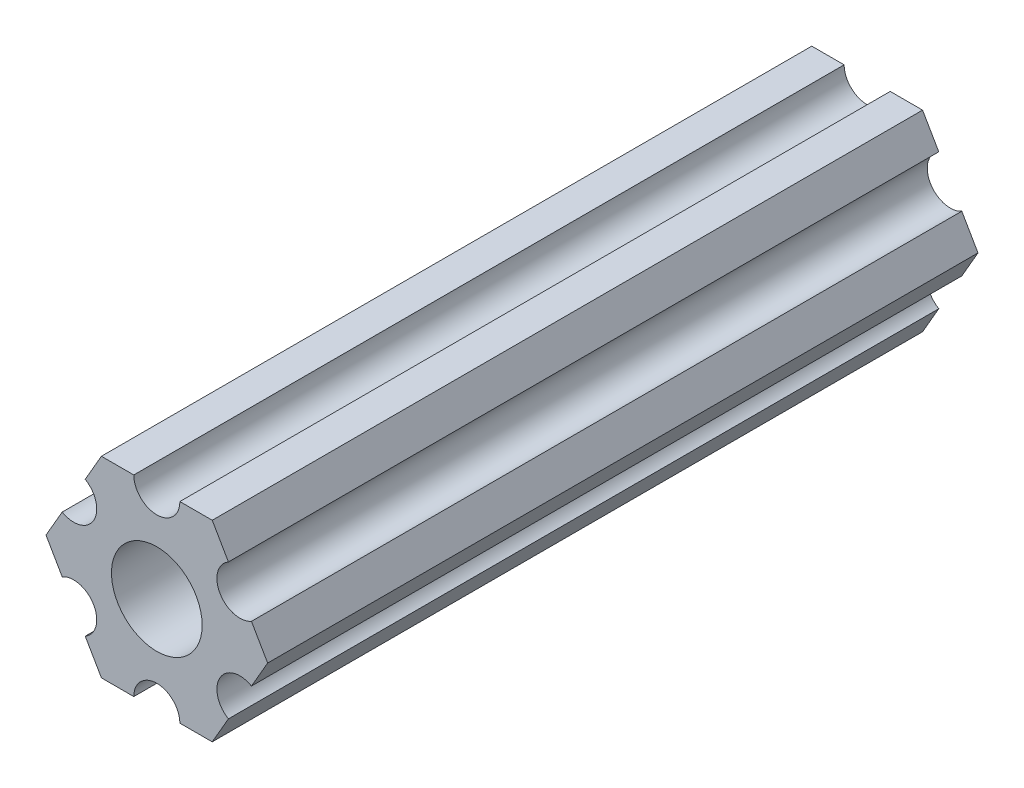
ISO-10303-21;
HEADER;
FILE_DESCRIPTION(('STEP AP214'),'2;1');
FILE_NAME('part.step','',(''),(''),'','','');
FILE_SCHEMA(('AUTOMOTIVE_DESIGN { 1 0 10303 214 1 1 1 1 }'));
ENDSEC;
DATA;
#1=APPLICATION_CONTEXT('core data for automotive mechanical design processes');
#2=APPLICATION_PROTOCOL_DEFINITION('international standard','automotive_design',2000,#1);
#3=PRODUCT_CONTEXT('',#1,'mechanical');
#4=PRODUCT('Part','Part','',(#3));
#5=PRODUCT_RELATED_PRODUCT_CATEGORY('part','',(#4));
#6=PRODUCT_DEFINITION_FORMATION('','',#4);
#7=PRODUCT_DEFINITION_CONTEXT('part definition',#1,'design');
#8=PRODUCT_DEFINITION('design','',#6,#7);
#9=PRODUCT_DEFINITION_SHAPE('','',#8);
#10=(LENGTH_UNIT() NAMED_UNIT(*) SI_UNIT(.MILLI.,.METRE.));
#11=(NAMED_UNIT(*) PLANE_ANGLE_UNIT() SI_UNIT($,.RADIAN.));
#12=(NAMED_UNIT(*) SI_UNIT($,.STERADIAN.) SOLID_ANGLE_UNIT());
#13=UNCERTAINTY_MEASURE_WITH_UNIT(LENGTH_MEASURE(1.E-05),#10,'distance_accuracy_value','');
#14=(GEOMETRIC_REPRESENTATION_CONTEXT(3) GLOBAL_UNCERTAINTY_ASSIGNED_CONTEXT((#13)) GLOBAL_UNIT_ASSIGNED_CONTEXT((#10,
#11,#12)) REPRESENTATION_CONTEXT('',''));
#15=CARTESIAN_POINT('',(0.,0.,0.));
#16=DIRECTION('',(0.,0.,1.));
#17=DIRECTION('',(1.,0.,0.));
#18=AXIS2_PLACEMENT_3D('',#15,#16,#17);
#19=CARTESIAN_POINT('',(-5.49926131403119,3.175,47.));
#20=DIRECTION('',(0.,0.,-1.));
#21=DIRECTION('',(-1.,0.,0.));
#22=AXIS2_PLACEMENT_3D('',#19,#20,#21);
#23=CYLINDRICAL_SURFACE('',#22,1.52400000000008);
#24=CARTESIAN_POINT('',(-5.49926131403119,3.175,0.));
#25=DIRECTION('',(0.,0.,1.));
#26=DIRECTION('',(1.,0.,0.));
#27=AXIS2_PLACEMENT_3D('',#24,#25,#26);
#28=CIRCLE('',#27,1.52400000000008);
#29=CARTESIAN_POINT('',(-6.26126131403123,1.85517728463245,0.));
#30=VERTEX_POINT('',#29);
#31=CARTESIAN_POINT('',(-4.73726131403115,4.49482271536755,0.));
#32=VERTEX_POINT('',#31);
#33=EDGE_CURVE('E190',#30,#32,#28,.T.);
#34=ORIENTED_EDGE('',*,*,#33,.F.);
#35=DIRECTION('',(0.,0.,-1.));
#36=VECTOR('',#35,1.);
#37=CARTESIAN_POINT('',(-6.26126131403123,1.85517728463245,47.));
#38=LINE('',#37,#36);
#39=CARTESIAN_POINT('',(-6.26126131403123,1.85517728463245,47.));
#40=VERTEX_POINT('',#39);
#41=EDGE_CURVE('E11',#40,#30,#38,.T.);
#42=ORIENTED_EDGE('',*,*,#41,.F.);
#43=CARTESIAN_POINT('',(-5.49926131403119,3.175,47.));
#44=DIRECTION('',(0.,0.,1.));
#45=DIRECTION('',(1.,0.,0.));
#46=AXIS2_PLACEMENT_3D('',#43,#44,#45);
#47=CIRCLE('',#46,1.52400000000008);
#48=CARTESIAN_POINT('',(-4.73726131403115,4.49482271536755,47.));
#49=VERTEX_POINT('',#48);
#50=EDGE_CURVE('E231',#40,#49,#47,.T.);
#51=ORIENTED_EDGE('',*,*,#50,.T.);
#52=DIRECTION('',(0.,0.,-1.));
#53=VECTOR('',#52,1.);
#54=CARTESIAN_POINT('',(-4.73726131403115,4.49482271536755,47.));
#55=LINE('',#54,#53);
#56=EDGE_CURVE('E114',#49,#32,#55,.T.);
#57=ORIENTED_EDGE('',*,*,#56,.T.);
#58=EDGE_LOOP('',(#34,#42,#51,#57));
#59=FACE_BOUND('',#58,.T.);
#60=ADVANCED_FACE('F34',(#59),#23,.F.);
#61=CARTESIAN_POINT('',(-5.49926131403118,3.175,47.));
#62=DIRECTION('',(0.866025403784438,-0.5,0.));
#63=DIRECTION('',(0.5,0.866025403784439,0.));
#64=AXIS2_PLACEMENT_3D('',#61,#62,#63);
#65=PLANE('',#64);
#66=DIRECTION('',(-0.5,-0.866025403784439,0.));
#67=VECTOR('',#66,1.);
#68=CARTESIAN_POINT('',(-5.49926131403118,3.175,0.));
#69=LINE('',#68,#67);
#70=CARTESIAN_POINT('',(-7.33234841870825,0.,0.));
#71=VERTEX_POINT('',#70);
#72=EDGE_CURVE('E193',#30,#71,#69,.T.);
#73=ORIENTED_EDGE('',*,*,#72,.T.);
#74=DIRECTION('',(0.,0.,-1.));
#75=VECTOR('',#74,1.);
#76=CARTESIAN_POINT('',(-7.33234841870825,0.,47.));
#77=LINE('',#76,#75);
#78=CARTESIAN_POINT('',(-7.33234841870825,0.,47.));
#79=VERTEX_POINT('',#78);
#80=EDGE_CURVE('E42',#79,#71,#77,.T.);
#81=ORIENTED_EDGE('',*,*,#80,.F.);
#82=DIRECTION('',(-0.5,-0.866025403784439,0.));
#83=VECTOR('',#82,1.);
#84=CARTESIAN_POINT('',(-5.49926131403118,3.175,47.));
#85=LINE('',#84,#83);
#86=EDGE_CURVE('E288',#40,#79,#85,.T.);
#87=ORIENTED_EDGE('',*,*,#86,.F.);
#88=ORIENTED_EDGE('',*,*,#41,.T.);
#89=EDGE_LOOP('',(#73,#81,#87,#88));
#90=FACE_BOUND('',#89,.T.);
#91=ADVANCED_FACE('F319',(#90),#65,.F.);
#92=CARTESIAN_POINT('',(-5.49926131403118,-3.175,47.));
#93=DIRECTION('',(0.866025403784439,0.5,0.));
#94=DIRECTION('',(-0.5,0.866025403784439,0.));
#95=AXIS2_PLACEMENT_3D('',#92,#93,#94);
#96=PLANE('',#95);
#97=DIRECTION('',(0.5,-0.866025403784439,0.));
#98=VECTOR('',#97,1.);
#99=CARTESIAN_POINT('',(-5.49926131403118,-3.175,0.));
#100=LINE('',#99,#98);
#101=CARTESIAN_POINT('',(-6.2612613140314,-1.85517728463214,0.));
#102=VERTEX_POINT('',#101);
#103=EDGE_CURVE('E195',#71,#102,#100,.T.);
#104=ORIENTED_EDGE('',*,*,#103,.T.);
#105=DIRECTION('',(0.,0.,-1.));
#106=VECTOR('',#105,1.);
#107=CARTESIAN_POINT('',(-6.2612613140314,-1.85517728463214,47.));
#108=LINE('',#107,#106);
#109=CARTESIAN_POINT('',(-6.2612613140314,-1.85517728463214,47.));
#110=VERTEX_POINT('',#109);
#111=EDGE_CURVE('E261',#110,#102,#108,.T.);
#112=ORIENTED_EDGE('',*,*,#111,.F.);
#113=DIRECTION('',(0.5,-0.866025403784439,0.));
#114=VECTOR('',#113,1.);
#115=CARTESIAN_POINT('',(-5.49926131403118,-3.175,47.));
#116=LINE('',#115,#114);
#117=EDGE_CURVE('E269',#79,#110,#116,.T.);
#118=ORIENTED_EDGE('',*,*,#117,.F.);
#119=ORIENTED_EDGE('',*,*,#80,.T.);
#120=EDGE_LOOP('',(#104,#112,#118,#119));
#121=FACE_BOUND('',#120,.T.);
#122=ADVANCED_FACE('F267',(#121),#96,.F.);
#123=CARTESIAN_POINT('',(-5.49926131403118,-3.175,47.));
#124=DIRECTION('',(0.,0.,-1.));
#125=DIRECTION('',(-1.,0.,0.));
#126=AXIS2_PLACEMENT_3D('',#123,#124,#125);
#127=CYLINDRICAL_SURFACE('',#126,1.52400000000043);
#128=CARTESIAN_POINT('',(-5.49926131403118,-3.175,0.));
#129=DIRECTION('',(0.,0.,1.));
#130=DIRECTION('',(1.,0.,0.));
#131=AXIS2_PLACEMENT_3D('',#128,#129,#130);
#132=CIRCLE('',#131,1.52400000000043);
#133=CARTESIAN_POINT('',(-4.73726131403097,-4.49482271536785,0.));
#134=VERTEX_POINT('',#133);
#135=EDGE_CURVE('E199',#134,#102,#132,.T.);
#136=ORIENTED_EDGE('',*,*,#135,.F.);
#137=DIRECTION('',(0.,0.,-1.));
#138=VECTOR('',#137,1.);
#139=CARTESIAN_POINT('',(-4.73726131403097,-4.49482271536785,47.));
#140=LINE('',#139,#138);
#141=CARTESIAN_POINT('',(-4.73726131403097,-4.49482271536785,47.));
#142=VERTEX_POINT('',#141);
#143=EDGE_CURVE('E259',#142,#134,#140,.T.);
#144=ORIENTED_EDGE('',*,*,#143,.F.);
#145=CARTESIAN_POINT('',(-5.49926131403118,-3.175,47.));
#146=DIRECTION('',(0.,0.,1.));
#147=DIRECTION('',(1.,0.,0.));
#148=AXIS2_PLACEMENT_3D('',#145,#146,#147);
#149=CIRCLE('',#148,1.52400000000043);
#150=EDGE_CURVE('E283',#142,#110,#149,.T.);
#151=ORIENTED_EDGE('',*,*,#150,.T.);
#152=ORIENTED_EDGE('',*,*,#111,.T.);
#153=EDGE_LOOP('',(#136,#144,#151,#152));
#154=FACE_BOUND('',#153,.T.);
#155=ADVANCED_FACE('F279',(#154),#127,.F.);
#156=CARTESIAN_POINT('',(-3.66617420935412,-6.35,0.));
#157=VERTEX_POINT('',#156);
#158=EDGE_CURVE('E200',#134,#157,#100,.T.);
#159=ORIENTED_EDGE('',*,*,#158,.T.);
#160=DIRECTION('',(0.,0.,-1.));
#161=VECTOR('',#160,1.);
#162=CARTESIAN_POINT('',(-3.66617420935412,-6.35,47.));
#163=LINE('',#162,#161);
#164=CARTESIAN_POINT('',(-3.66617420935412,-6.35,47.));
#165=VERTEX_POINT('',#164);
#166=EDGE_CURVE('E256',#165,#157,#163,.T.);
#167=ORIENTED_EDGE('',*,*,#166,.F.);
#168=EDGE_CURVE('E284',#142,#165,#116,.T.);
#169=ORIENTED_EDGE('',*,*,#168,.F.);
#170=ORIENTED_EDGE('',*,*,#143,.T.);
#171=EDGE_LOOP('',(#159,#167,#169,#170));
#172=FACE_BOUND('',#171,.T.);
#173=ADVANCED_FACE('F328',(#172),#96,.F.);
#174=CARTESIAN_POINT('',(0.,-6.35,47.));
#175=DIRECTION('',(0.,1.,0.));
#176=DIRECTION('',(0.,0.,1.));
#177=AXIS2_PLACEMENT_3D('',#174,#175,#176);
#178=PLANE('',#177);
#179=DIRECTION('',(1.,0.,0.));
#180=VECTOR('',#179,1.);
#181=CARTESIAN_POINT('',(0.,-6.35,0.));
#182=LINE('',#181,#180);
#183=CARTESIAN_POINT('',(-1.5240000000007,-6.35,0.));
#184=VERTEX_POINT('',#183);
#185=EDGE_CURVE('E203',#157,#184,#182,.T.);
#186=ORIENTED_EDGE('',*,*,#185,.T.);
#187=DIRECTION('',(0.,0.,-1.));
#188=VECTOR('',#187,1.);
#189=CARTESIAN_POINT('',(-1.5240000000007,-6.35,47.));
#190=LINE('',#189,#188);
#191=CARTESIAN_POINT('',(-1.5240000000007,-6.35,47.));
#192=VERTEX_POINT('',#191);
#193=EDGE_CURVE('E254',#192,#184,#190,.T.);
#194=ORIENTED_EDGE('',*,*,#193,.F.);
#195=DIRECTION('',(1.,0.,0.));
#196=VECTOR('',#195,1.);
#197=CARTESIAN_POINT('',(0.,-6.35,47.));
#198=LINE('',#197,#196);
#199=EDGE_CURVE('E286',#165,#192,#198,.T.);
#200=ORIENTED_EDGE('',*,*,#199,.F.);
#201=ORIENTED_EDGE('',*,*,#166,.T.);
#202=EDGE_LOOP('',(#186,#194,#200,#201));
#203=FACE_BOUND('',#202,.T.);
#204=ADVANCED_FACE('F388',(#203),#178,.F.);
#205=CARTESIAN_POINT('',(0.,-6.34999999999999,47.));
#206=DIRECTION('',(0.,0.,-1.));
#207=DIRECTION('',(-1.,0.,0.));
#208=AXIS2_PLACEMENT_3D('',#205,#206,#207);
#209=CYLINDRICAL_SURFACE('',#208,1.52400000000069);
#210=CARTESIAN_POINT('',(0.,-6.34999999999999,0.));
#211=DIRECTION('',(0.,0.,1.));
#212=DIRECTION('',(1.,0.,0.));
#213=AXIS2_PLACEMENT_3D('',#210,#211,#212);
#214=CIRCLE('',#213,1.52400000000069);
#215=CARTESIAN_POINT('',(1.52400000000069,-6.35,0.));
#216=VERTEX_POINT('',#215);
#217=EDGE_CURVE('E206',#216,#184,#214,.T.);
#218=ORIENTED_EDGE('',*,*,#217,.F.);
#219=DIRECTION('',(0.,0.,-1.));
#220=VECTOR('',#219,1.);
#221=CARTESIAN_POINT('',(1.52400000000069,-6.35,47.));
#222=LINE('',#221,#220);
#223=CARTESIAN_POINT('',(1.52400000000069,-6.35,47.));
#224=VERTEX_POINT('',#223);
#225=EDGE_CURVE('E252',#224,#216,#222,.T.);
#226=ORIENTED_EDGE('',*,*,#225,.F.);
#227=CARTESIAN_POINT('',(0.,-6.34999999999999,47.));
#228=DIRECTION('',(0.,0.,1.));
#229=DIRECTION('',(1.,0.,0.));
#230=AXIS2_PLACEMENT_3D('',#227,#228,#229);
#231=CIRCLE('',#230,1.52400000000069);
#232=EDGE_CURVE('E292',#224,#192,#231,.T.);
#233=ORIENTED_EDGE('',*,*,#232,.T.);
#234=ORIENTED_EDGE('',*,*,#193,.T.);
#235=EDGE_LOOP('',(#218,#226,#233,#234));
#236=FACE_BOUND('',#235,.T.);
#237=ADVANCED_FACE('F382',(#236),#209,.F.);
#238=CARTESIAN_POINT('',(3.66617420935412,-6.35,0.));
#239=VERTEX_POINT('',#238);
#240=EDGE_CURVE('E207',#216,#239,#182,.T.);
#241=ORIENTED_EDGE('',*,*,#240,.T.);
#242=DIRECTION('',(0.,0.,-1.));
#243=VECTOR('',#242,1.);
#244=CARTESIAN_POINT('',(3.66617420935412,-6.35,47.));
#245=LINE('',#244,#243);
#246=CARTESIAN_POINT('',(3.66617420935412,-6.35,47.));
#247=VERTEX_POINT('',#246);
#248=EDGE_CURVE('E249',#247,#239,#245,.T.);
#249=ORIENTED_EDGE('',*,*,#248,.F.);
#250=EDGE_CURVE('E293',#224,#247,#198,.T.);
#251=ORIENTED_EDGE('',*,*,#250,.F.);
#252=ORIENTED_EDGE('',*,*,#225,.T.);
#253=EDGE_LOOP('',(#241,#249,#251,#252));
#254=FACE_BOUND('',#253,.T.);
#255=ADVANCED_FACE('F391',(#254),#178,.F.);
#256=CARTESIAN_POINT('',(5.49926131403118,-3.175,47.));
#257=DIRECTION('',(-0.866025403784438,0.5,0.));
#258=DIRECTION('',(-0.5,-0.866025403784439,0.));
#259=AXIS2_PLACEMENT_3D('',#256,#257,#258);
#260=PLANE('',#259);
#261=DIRECTION('',(0.5,0.866025403784439,0.));
#262=VECTOR('',#261,1.);
#263=CARTESIAN_POINT('',(5.49926131403118,-3.175,0.));
#264=LINE('',#263,#262);
#265=CARTESIAN_POINT('',(4.73726131403088,-4.49482271536802,0.));
#266=VERTEX_POINT('',#265);
#267=EDGE_CURVE('E210',#239,#266,#264,.T.);
#268=ORIENTED_EDGE('',*,*,#267,.T.);
#269=DIRECTION('',(0.,0.,-1.));
#270=VECTOR('',#269,1.);
#271=CARTESIAN_POINT('',(4.73726131403088,-4.49482271536802,47.));
#272=LINE('',#271,#270);
#273=CARTESIAN_POINT('',(4.73726131403088,-4.49482271536802,47.));
#274=VERTEX_POINT('',#273);
#275=EDGE_CURVE('E247',#274,#266,#272,.T.);
#276=ORIENTED_EDGE('',*,*,#275,.F.);
#277=DIRECTION('',(0.5,0.866025403784439,0.));
#278=VECTOR('',#277,1.);
#279=CARTESIAN_POINT('',(5.49926131403118,-3.175,47.));
#280=LINE('',#279,#278);
#281=EDGE_CURVE('E296',#247,#274,#280,.T.);
#282=ORIENTED_EDGE('',*,*,#281,.F.);
#283=ORIENTED_EDGE('',*,*,#248,.T.);
#284=EDGE_LOOP('',(#268,#276,#282,#283));
#285=FACE_BOUND('',#284,.T.);
#286=ADVANCED_FACE('F362',(#285),#260,.F.);
#287=CARTESIAN_POINT('',(5.49926131403118,-3.17499999999999,47.));
#288=DIRECTION('',(0.,0.,-1.));
#289=DIRECTION('',(-1.,0.,0.));
#290=AXIS2_PLACEMENT_3D('',#287,#288,#289);
#291=CYLINDRICAL_SURFACE('',#290,1.52400000000062);
#292=CARTESIAN_POINT('',(5.49926131403118,-3.17499999999999,0.));
#293=DIRECTION('',(0.,0.,1.));
#294=DIRECTION('',(1.,0.,0.));
#295=AXIS2_PLACEMENT_3D('',#292,#293,#294);
#296=CIRCLE('',#295,1.52400000000062);
#297=CARTESIAN_POINT('',(6.26126131403149,-1.85517728463198,0.));
#298=VERTEX_POINT('',#297);
#299=EDGE_CURVE('E213',#298,#266,#296,.T.);
#300=ORIENTED_EDGE('',*,*,#299,.F.);
#301=DIRECTION('',(0.,0.,-1.));
#302=VECTOR('',#301,1.);
#303=CARTESIAN_POINT('',(6.26126131403149,-1.85517728463198,47.));
#304=LINE('',#303,#302);
#305=CARTESIAN_POINT('',(6.26126131403149,-1.85517728463198,47.));
#306=VERTEX_POINT('',#305);
#307=EDGE_CURVE('E245',#306,#298,#304,.T.);
#308=ORIENTED_EDGE('',*,*,#307,.F.);
#309=CARTESIAN_POINT('',(5.49926131403118,-3.17499999999999,47.));
#310=DIRECTION('',(0.,0.,1.));
#311=DIRECTION('',(1.,0.,0.));
#312=AXIS2_PLACEMENT_3D('',#309,#310,#311);
#313=CIRCLE('',#312,1.52400000000062);
#314=EDGE_CURVE('E298',#306,#274,#313,.T.);
#315=ORIENTED_EDGE('',*,*,#314,.T.);
#316=ORIENTED_EDGE('',*,*,#275,.T.);
#317=EDGE_LOOP('',(#300,#308,#315,#316));
#318=FACE_BOUND('',#317,.T.);
#319=ADVANCED_FACE('F359',(#318),#291,.F.);
#320=CARTESIAN_POINT('',(7.33234841870825,0.,0.));
#321=VERTEX_POINT('',#320);
#322=EDGE_CURVE('E214',#298,#321,#264,.T.);
#323=ORIENTED_EDGE('',*,*,#322,.T.);
#324=DIRECTION('',(0.,0.,-1.));
#325=VECTOR('',#324,1.);
#326=CARTESIAN_POINT('',(7.33234841870825,0.,47.));
#327=LINE('',#326,#325);
#328=CARTESIAN_POINT('',(7.33234841870825,0.,47.));
#329=VERTEX_POINT('',#328);
#330=EDGE_CURVE('E242',#329,#321,#327,.T.);
#331=ORIENTED_EDGE('',*,*,#330,.F.);
#332=EDGE_CURVE('E299',#306,#329,#280,.T.);
#333=ORIENTED_EDGE('',*,*,#332,.F.);
#334=ORIENTED_EDGE('',*,*,#307,.T.);
#335=EDGE_LOOP('',(#323,#331,#333,#334));
#336=FACE_BOUND('',#335,.T.);
#337=ADVANCED_FACE('F354',(#336),#260,.F.);
#338=CARTESIAN_POINT('',(5.49926131403118,3.175,47.));
#339=DIRECTION('',(-0.866025403784439,-0.5,0.));
#340=DIRECTION('',(0.5,-0.866025403784439,0.));
#341=AXIS2_PLACEMENT_3D('',#338,#339,#340);
#342=PLANE('',#341);
#343=DIRECTION('',(-0.5,0.866025403784439,0.));
#344=VECTOR('',#343,1.);
#345=CARTESIAN_POINT('',(5.49926131403118,3.175,0.));
#346=LINE('',#345,#344);
#347=CARTESIAN_POINT('',(6.26126131403132,1.85517728463229,0.));
#348=VERTEX_POINT('',#347);
#349=EDGE_CURVE('E217',#321,#348,#346,.T.);
#350=ORIENTED_EDGE('',*,*,#349,.T.);
#351=DIRECTION('',(0.,0.,-1.));
#352=VECTOR('',#351,1.);
#353=CARTESIAN_POINT('',(6.26126131403132,1.85517728463229,47.));
#354=LINE('',#353,#352);
#355=CARTESIAN_POINT('',(6.26126131403132,1.85517728463229,47.));
#356=VERTEX_POINT('',#355);
#357=EDGE_CURVE('E240',#356,#348,#354,.T.);
#358=ORIENTED_EDGE('',*,*,#357,.F.);
#359=DIRECTION('',(-0.5,0.866025403784439,0.));
#360=VECTOR('',#359,1.);
#361=CARTESIAN_POINT('',(5.49926131403118,3.175,47.));
#362=LINE('',#361,#360);
#363=EDGE_CURVE('E302',#329,#356,#362,.T.);
#364=ORIENTED_EDGE('',*,*,#363,.F.);
#365=ORIENTED_EDGE('',*,*,#330,.T.);
#366=EDGE_LOOP('',(#350,#358,#364,#365));
#367=FACE_BOUND('',#366,.T.);
#368=ADVANCED_FACE('F348',(#367),#342,.F.);
#369=CARTESIAN_POINT('',(5.49926131403118,3.175,47.));
#370=DIRECTION('',(0.,0.,-1.));
#371=DIRECTION('',(-1.,0.,0.));
#372=AXIS2_PLACEMENT_3D('',#369,#370,#371);
#373=CYLINDRICAL_SURFACE('',#372,1.52400000000027);
#374=CARTESIAN_POINT('',(5.49926131403118,3.175,0.));
#375=DIRECTION('',(0.,0.,1.));
#376=DIRECTION('',(1.,0.,0.));
#377=AXIS2_PLACEMENT_3D('',#374,#375,#376);
#378=CIRCLE('',#377,1.52400000000027);
#379=CARTESIAN_POINT('',(4.73726131403105,4.49482271536772,0.));
#380=VERTEX_POINT('',#379);
#381=EDGE_CURVE('E220',#380,#348,#378,.T.);
#382=ORIENTED_EDGE('',*,*,#381,.F.);
#383=DIRECTION('',(0.,0.,-1.));
#384=VECTOR('',#383,1.);
#385=CARTESIAN_POINT('',(4.73726131403105,4.49482271536772,47.));
#386=LINE('',#385,#384);
#387=CARTESIAN_POINT('',(4.73726131403105,4.49482271536772,47.));
#388=VERTEX_POINT('',#387);
#389=EDGE_CURVE('E238',#388,#380,#386,.T.);
#390=ORIENTED_EDGE('',*,*,#389,.F.);
#391=CARTESIAN_POINT('',(5.49926131403118,3.175,47.));
#392=DIRECTION('',(0.,0.,1.));
#393=DIRECTION('',(1.,0.,0.));
#394=AXIS2_PLACEMENT_3D('',#391,#392,#393);
#395=CIRCLE('',#394,1.52400000000027);
#396=EDGE_CURVE('E303',#388,#356,#395,.T.);
#397=ORIENTED_EDGE('',*,*,#396,.T.);
#398=ORIENTED_EDGE('',*,*,#357,.T.);
#399=EDGE_LOOP('',(#382,#390,#397,#398));
#400=FACE_BOUND('',#399,.T.);
#401=ADVANCED_FACE('F346',(#400),#373,.F.);
#402=CARTESIAN_POINT('',(3.66617420935413,6.35,0.));
#403=VERTEX_POINT('',#402);
#404=EDGE_CURVE('E221',#380,#403,#346,.T.);
#405=ORIENTED_EDGE('',*,*,#404,.T.);
#406=DIRECTION('',(0.,0.,-1.));
#407=VECTOR('',#406,1.);
#408=CARTESIAN_POINT('',(3.66617420935413,6.35,47.));
#409=LINE('',#408,#407);
#410=CARTESIAN_POINT('',(3.66617420935413,6.35,47.));
#411=VERTEX_POINT('',#410);
#412=EDGE_CURVE('E235',#411,#403,#409,.T.);
#413=ORIENTED_EDGE('',*,*,#412,.F.);
#414=EDGE_CURVE('E184',#388,#411,#362,.T.);
#415=ORIENTED_EDGE('',*,*,#414,.F.);
#416=ORIENTED_EDGE('',*,*,#389,.T.);
#417=EDGE_LOOP('',(#405,#413,#415,#416));
#418=FACE_BOUND('',#417,.T.);
#419=ADVANCED_FACE('F310',(#418),#342,.F.);
#420=CARTESIAN_POINT('',(0.,6.35,47.));
#421=DIRECTION('',(0.,-1.,0.));
#422=DIRECTION('',(1.,0.,0.));
#423=AXIS2_PLACEMENT_3D('',#420,#421,#422);
#424=PLANE('',#423);
#425=DIRECTION('',(-1.,0.,0.));
#426=VECTOR('',#425,1.);
#427=CARTESIAN_POINT('',(0.,6.35,0.));
#428=LINE('',#427,#426);
#429=CARTESIAN_POINT('',(1.524,6.35,0.));
#430=VERTEX_POINT('',#429);
#431=EDGE_CURVE('E224',#403,#430,#428,.T.);
#432=ORIENTED_EDGE('',*,*,#431,.T.);
#433=DIRECTION('',(0.,0.,-1.));
#434=VECTOR('',#433,1.);
#435=CARTESIAN_POINT('',(1.524,6.35,47.));
#436=LINE('',#435,#434);
#437=CARTESIAN_POINT('',(1.524,6.35,47.));
#438=VERTEX_POINT('',#437);
#439=EDGE_CURVE('E172',#438,#430,#436,.T.);
#440=ORIENTED_EDGE('',*,*,#439,.F.);
#441=DIRECTION('',(-1.,0.,0.));
#442=VECTOR('',#441,1.);
#443=CARTESIAN_POINT('',(0.,6.35,47.));
#444=LINE('',#443,#442);
#445=EDGE_CURVE('E178',#411,#438,#444,.T.);
#446=ORIENTED_EDGE('',*,*,#445,.F.);
#447=ORIENTED_EDGE('',*,*,#412,.T.);
#448=EDGE_LOOP('',(#432,#440,#446,#447));
#449=FACE_BOUND('',#448,.T.);
#450=ADVANCED_FACE('F314',(#449),#424,.F.);
#451=CARTESIAN_POINT('',(0.,6.35,47.));
#452=DIRECTION('',(0.,0.,-1.));
#453=DIRECTION('',(-1.,0.,0.));
#454=AXIS2_PLACEMENT_3D('',#451,#452,#453);
#455=CYLINDRICAL_SURFACE('',#454,1.524);
#456=CARTESIAN_POINT('',(0.,6.35,0.));
#457=DIRECTION('',(0.,0.,1.));
#458=DIRECTION('',(1.,0.,0.));
#459=AXIS2_PLACEMENT_3D('',#456,#457,#458);
#460=CIRCLE('',#459,1.524);
#461=CARTESIAN_POINT('',(-1.524,6.35,0.));
#462=VERTEX_POINT('',#461);
#463=EDGE_CURVE('E171',#462,#430,#460,.T.);
#464=ORIENTED_EDGE('',*,*,#463,.F.);
#465=DIRECTION('',(0.,0.,-1.));
#466=VECTOR('',#465,1.);
#467=CARTESIAN_POINT('',(-1.524,6.35,47.));
#468=LINE('',#467,#466);
#469=CARTESIAN_POINT('',(-1.524,6.35,47.));
#470=VERTEX_POINT('',#469);
#471=EDGE_CURVE('E165',#470,#462,#468,.T.);
#472=ORIENTED_EDGE('',*,*,#471,.F.);
#473=CARTESIAN_POINT('',(0.,6.35,47.));
#474=DIRECTION('',(0.,0.,1.));
#475=DIRECTION('',(1.,0.,0.));
#476=AXIS2_PLACEMENT_3D('',#473,#474,#475);
#477=CIRCLE('',#476,1.524);
#478=EDGE_CURVE('E169',#470,#438,#477,.T.);
#479=ORIENTED_EDGE('',*,*,#478,.T.);
#480=ORIENTED_EDGE('',*,*,#439,.T.);
#481=EDGE_LOOP('',(#464,#472,#479,#480));
#482=FACE_BOUND('',#481,.T.);
#483=ADVANCED_FACE('F167',(#482),#455,.F.);
#484=CARTESIAN_POINT('',(-3.66617420935412,6.35,0.));
#485=VERTEX_POINT('',#484);
#486=EDGE_CURVE('E107',#462,#485,#428,.T.);
#487=ORIENTED_EDGE('',*,*,#486,.T.);
#488=DIRECTION('',(0.,0.,-1.));
#489=VECTOR('',#488,1.);
#490=CARTESIAN_POINT('',(-3.66617420935412,6.35,47.));
#491=LINE('',#490,#489);
#492=CARTESIAN_POINT('',(-3.66617420935412,6.35,47.));
#493=VERTEX_POINT('',#492);
#494=EDGE_CURVE('E173',#493,#485,#491,.T.);
#495=ORIENTED_EDGE('',*,*,#494,.F.);
#496=EDGE_CURVE('E175',#470,#493,#444,.T.);
#497=ORIENTED_EDGE('',*,*,#496,.F.);
#498=ORIENTED_EDGE('',*,*,#471,.T.);
#499=EDGE_LOOP('',(#487,#495,#497,#498));
#500=FACE_BOUND('',#499,.T.);
#501=ADVANCED_FACE('F176',(#500),#424,.F.);
#502=EDGE_CURVE('E196',#485,#32,#69,.T.);
#503=ORIENTED_EDGE('',*,*,#502,.T.);
#504=ORIENTED_EDGE('',*,*,#56,.F.);
#505=EDGE_CURVE('E50',#493,#49,#85,.T.);
#506=ORIENTED_EDGE('',*,*,#505,.F.);
#507=ORIENTED_EDGE('',*,*,#494,.T.);
#508=EDGE_LOOP('',(#503,#504,#506,#507));
#509=FACE_BOUND('',#508,.T.);
#510=ADVANCED_FACE('F317',(#509),#65,.F.);
#511=CARTESIAN_POINT('',(0.,0.,47.));
#512=DIRECTION('',(0.,0.,-1.));
#513=DIRECTION('',(-1.,0.,0.));
#514=AXIS2_PLACEMENT_3D('',#511,#512,#513);
#515=CYLINDRICAL_SURFACE('',#514,3.);
#516=CARTESIAN_POINT('',(0.,0.,47.));
#517=DIRECTION('',(0.,0.,1.));
#518=DIRECTION('',(1.,0.,0.));
#519=AXIS2_PLACEMENT_3D('',#516,#517,#518);
#520=CIRCLE('',#519,3.);
#521=CARTESIAN_POINT('',(3.,0.,47.));
#522=VERTEX_POINT('',#521);
#523=EDGE_CURVE('E187',#522,#522,#520,.T.);
#524=ORIENTED_EDGE('',*,*,#523,.T.);
#525=EDGE_LOOP('',(#524));
#526=FACE_BOUND('',#525,.T.);
#527=CARTESIAN_POINT('',(0.,0.,0.));
#528=DIRECTION('',(0.,0.,1.));
#529=DIRECTION('',(1.,0.,0.));
#530=AXIS2_PLACEMENT_3D('',#527,#528,#529);
#531=CIRCLE('',#530,3.);
#532=CARTESIAN_POINT('',(3.,0.,0.));
#533=VERTEX_POINT('',#532);
#534=EDGE_CURVE('E228',#533,#533,#531,.T.);
#535=ORIENTED_EDGE('',*,*,#534,.F.);
#536=EDGE_LOOP('',(#535));
#537=FACE_BOUND('',#536,.T.);
#538=ADVANCED_FACE('F332',(#526,#537),#515,.F.);
#539=CARTESIAN_POINT('',(0.,0.,47.));
#540=DIRECTION('',(0.,0.,1.));
#541=DIRECTION('',(1.,0.,0.));
#542=AXIS2_PLACEMENT_3D('',#539,#540,#541);
#543=PLANE('',#542);
#544=ORIENTED_EDGE('',*,*,#50,.F.);
#545=ORIENTED_EDGE('',*,*,#86,.T.);
#546=ORIENTED_EDGE('',*,*,#117,.T.);
#547=ORIENTED_EDGE('',*,*,#150,.F.);
#548=ORIENTED_EDGE('',*,*,#168,.T.);
#549=ORIENTED_EDGE('',*,*,#199,.T.);
#550=ORIENTED_EDGE('',*,*,#232,.F.);
#551=ORIENTED_EDGE('',*,*,#250,.T.);
#552=ORIENTED_EDGE('',*,*,#281,.T.);
#553=ORIENTED_EDGE('',*,*,#314,.F.);
#554=ORIENTED_EDGE('',*,*,#332,.T.);
#555=ORIENTED_EDGE('',*,*,#363,.T.);
#556=ORIENTED_EDGE('',*,*,#396,.F.);
#557=ORIENTED_EDGE('',*,*,#414,.T.);
#558=ORIENTED_EDGE('',*,*,#445,.T.);
#559=ORIENTED_EDGE('',*,*,#478,.F.);
#560=ORIENTED_EDGE('',*,*,#496,.T.);
#561=ORIENTED_EDGE('',*,*,#505,.T.);
#562=EDGE_LOOP('',(#544,#545,#546,#547,#548,#549,#550,#551,#552,#553,#554,#555,#556,#557,#558,
#559,#560,#561));
#563=FACE_BOUND('',#562,.T.);
#564=ORIENTED_EDGE('',*,*,#523,.F.);
#565=EDGE_LOOP('',(#564));
#566=FACE_BOUND('',#565,.T.);
#567=ADVANCED_FACE('F179',(#563,#566),#543,.T.);
#568=CARTESIAN_POINT('',(0.,0.,0.));
#569=DIRECTION('',(0.,0.,1.));
#570=DIRECTION('',(1.,0.,0.));
#571=AXIS2_PLACEMENT_3D('',#568,#569,#570);
#572=PLANE('',#571);
#573=ORIENTED_EDGE('',*,*,#33,.T.);
#574=ORIENTED_EDGE('',*,*,#502,.F.);
#575=ORIENTED_EDGE('',*,*,#486,.F.);
#576=ORIENTED_EDGE('',*,*,#463,.T.);
#577=ORIENTED_EDGE('',*,*,#431,.F.);
#578=ORIENTED_EDGE('',*,*,#404,.F.);
#579=ORIENTED_EDGE('',*,*,#381,.T.);
#580=ORIENTED_EDGE('',*,*,#349,.F.);
#581=ORIENTED_EDGE('',*,*,#322,.F.);
#582=ORIENTED_EDGE('',*,*,#299,.T.);
#583=ORIENTED_EDGE('',*,*,#267,.F.);
#584=ORIENTED_EDGE('',*,*,#240,.F.);
#585=ORIENTED_EDGE('',*,*,#217,.T.);
#586=ORIENTED_EDGE('',*,*,#185,.F.);
#587=ORIENTED_EDGE('',*,*,#158,.F.);
#588=ORIENTED_EDGE('',*,*,#135,.T.);
#589=ORIENTED_EDGE('',*,*,#103,.F.);
#590=ORIENTED_EDGE('',*,*,#72,.F.);
#591=EDGE_LOOP('',(#573,#574,#575,#576,#577,#578,#579,#580,#581,#582,#583,#584,#585,#586,#587,
#588,#589,#590));
#592=FACE_BOUND('',#591,.T.);
#593=ORIENTED_EDGE('',*,*,#534,.T.);
#594=EDGE_LOOP('',(#593));
#595=FACE_BOUND('',#594,.T.);
#596=ADVANCED_FACE('F273',(#592,#595),#572,.F.);
#597=CLOSED_SHELL('',(#60,#91,#122,#155,#173,#204,#237,#255,#286,#319,#337,#368,#401,#419,#450,
#483,#501,#510,#538,#567,#596));
#598=MANIFOLD_SOLID_BREP('B2',#597);
#599=ADVANCED_BREP_SHAPE_REPRESENTATION('',(#18,#598),#14);
#600=SHAPE_DEFINITION_REPRESENTATION(#9,#599);
ENDSEC;
END-ISO-10303-21;
